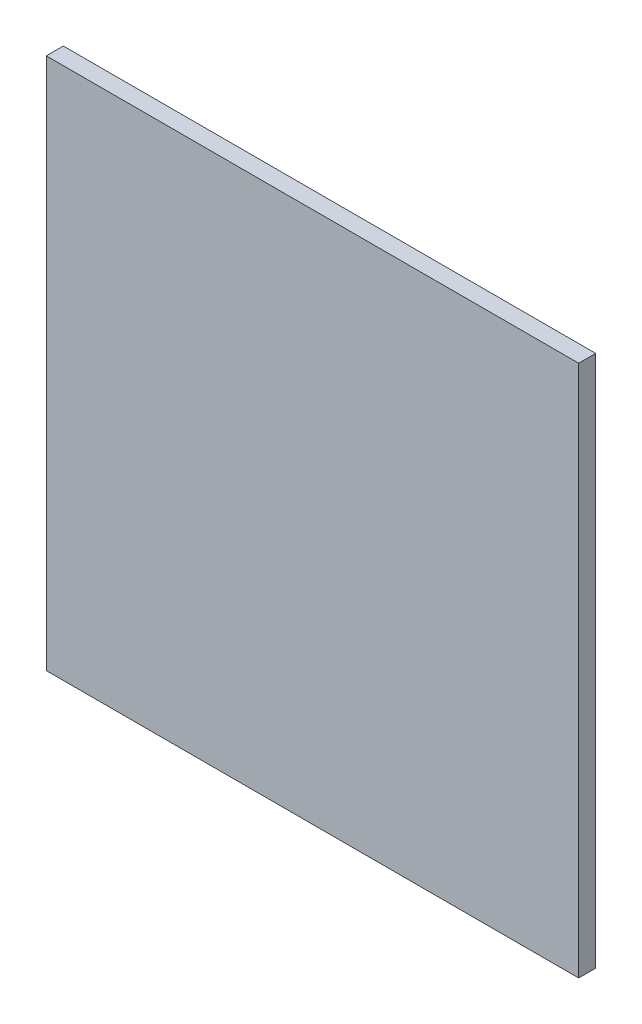
ISO-10303-21;
HEADER;
FILE_DESCRIPTION(('STEP AP214'),'2;1');
FILE_NAME('part.step','',(''),(''),'','','');
FILE_SCHEMA(('AUTOMOTIVE_DESIGN { 1 0 10303 214 1 1 1 1 }'));
ENDSEC;
DATA;
#1=APPLICATION_CONTEXT('core data for automotive mechanical design processes');
#2=APPLICATION_PROTOCOL_DEFINITION('international standard','automotive_design',2000,#1);
#3=PRODUCT_CONTEXT('',#1,'mechanical');
#4=PRODUCT('Part','Part','',(#3));
#5=PRODUCT_RELATED_PRODUCT_CATEGORY('part','',(#4));
#6=PRODUCT_DEFINITION_FORMATION('','',#4);
#7=PRODUCT_DEFINITION_CONTEXT('part definition',#1,'design');
#8=PRODUCT_DEFINITION('design','',#6,#7);
#9=PRODUCT_DEFINITION_SHAPE('','',#8);
#10=(LENGTH_UNIT() NAMED_UNIT(*) SI_UNIT(.MILLI.,.METRE.));
#11=(NAMED_UNIT(*) PLANE_ANGLE_UNIT() SI_UNIT($,.RADIAN.));
#12=(NAMED_UNIT(*) SI_UNIT($,.STERADIAN.) SOLID_ANGLE_UNIT());
#13=UNCERTAINTY_MEASURE_WITH_UNIT(LENGTH_MEASURE(1.E-05),#10,'distance_accuracy_value','');
#14=(GEOMETRIC_REPRESENTATION_CONTEXT(3) GLOBAL_UNCERTAINTY_ASSIGNED_CONTEXT((#13)) GLOBAL_UNIT_ASSIGNED_CONTEXT((#10,
#11,#12)) REPRESENTATION_CONTEXT('',''));
#15=CARTESIAN_POINT('',(0.,0.,0.));
#16=DIRECTION('',(0.,0.,1.));
#17=DIRECTION('',(1.,0.,0.));
#18=AXIS2_PLACEMENT_3D('',#15,#16,#17);
#19=CARTESIAN_POINT('',(50.,-50.,3.2));
#20=DIRECTION('',(-1.,0.,0.));
#21=DIRECTION('',(0.,0.,1.));
#22=AXIS2_PLACEMENT_3D('',#19,#20,#21);
#23=PLANE('',#22);
#24=DIRECTION('',(0.,1.,0.));
#25=VECTOR('',#24,1.);
#26=CARTESIAN_POINT('',(50.,-50.,0.));
#27=LINE('',#26,#25);
#28=CARTESIAN_POINT('',(50.,-50.,0.));
#29=VERTEX_POINT('',#28);
#30=CARTESIAN_POINT('',(50.,50.,0.));
#31=VERTEX_POINT('',#30);
#32=EDGE_CURVE('E96',#29,#31,#27,.T.);
#33=ORIENTED_EDGE('',*,*,#32,.T.);
#34=DIRECTION('',(0.,0.,-1.));
#35=VECTOR('',#34,1.);
#36=CARTESIAN_POINT('',(50.,50.,3.2));
#37=LINE('',#36,#35);
#38=CARTESIAN_POINT('',(50.,50.,3.2));
#39=VERTEX_POINT('',#38);
#40=EDGE_CURVE('E11',#39,#31,#37,.T.);
#41=ORIENTED_EDGE('',*,*,#40,.F.);
#42=DIRECTION('',(0.,1.,0.));
#43=VECTOR('',#42,1.);
#44=CARTESIAN_POINT('',(50.,-50.,3.2));
#45=LINE('',#44,#43);
#46=CARTESIAN_POINT('',(50.,-50.,3.2));
#47=VERTEX_POINT('',#46);
#48=EDGE_CURVE('E84',#47,#39,#45,.T.);
#49=ORIENTED_EDGE('',*,*,#48,.F.);
#50=DIRECTION('',(0.,0.,-1.));
#51=VECTOR('',#50,1.);
#52=CARTESIAN_POINT('',(50.,-50.,3.2));
#53=LINE('',#52,#51);
#54=EDGE_CURVE('E92',#47,#29,#53,.T.);
#55=ORIENTED_EDGE('',*,*,#54,.T.);
#56=EDGE_LOOP('',(#33,#41,#49,#55));
#57=FACE_BOUND('',#56,.T.);
#58=ADVANCED_FACE('F33',(#57),#23,.F.);
#59=CARTESIAN_POINT('',(-50.,50.,3.2));
#60=DIRECTION('',(0.,-1.,0.));
#61=DIRECTION('',(0.,0.,-1.));
#62=AXIS2_PLACEMENT_3D('',#59,#60,#61);
#63=PLANE('',#62);
#64=DIRECTION('',(-1.,0.,0.));
#65=VECTOR('',#64,1.);
#66=CARTESIAN_POINT('',(-50.,50.,0.));
#67=LINE('',#66,#65);
#68=CARTESIAN_POINT('',(-50.,50.,0.));
#69=VERTEX_POINT('',#68);
#70=EDGE_CURVE('E88',#31,#69,#67,.T.);
#71=ORIENTED_EDGE('',*,*,#70,.T.);
#72=DIRECTION('',(0.,0.,-1.));
#73=VECTOR('',#72,1.);
#74=CARTESIAN_POINT('',(-50.,50.,3.2));
#75=LINE('',#74,#73);
#76=CARTESIAN_POINT('',(-50.,50.,3.2));
#77=VERTEX_POINT('',#76);
#78=EDGE_CURVE('E41',#77,#69,#75,.T.);
#79=ORIENTED_EDGE('',*,*,#78,.F.);
#80=DIRECTION('',(-1.,0.,0.));
#81=VECTOR('',#80,1.);
#82=CARTESIAN_POINT('',(-50.,50.,3.2));
#83=LINE('',#82,#81);
#84=EDGE_CURVE('E79',#39,#77,#83,.T.);
#85=ORIENTED_EDGE('',*,*,#84,.F.);
#86=ORIENTED_EDGE('',*,*,#40,.T.);
#87=EDGE_LOOP('',(#71,#79,#85,#86));
#88=FACE_BOUND('',#87,.T.);
#89=ADVANCED_FACE('F87',(#88),#63,.F.);
#90=CARTESIAN_POINT('',(-50.,-50.,3.2));
#91=DIRECTION('',(1.,0.,0.));
#92=DIRECTION('',(0.,0.,-1.));
#93=AXIS2_PLACEMENT_3D('',#90,#91,#92);
#94=PLANE('',#93);
#95=DIRECTION('',(0.,-1.,0.));
#96=VECTOR('',#95,1.);
#97=CARTESIAN_POINT('',(-50.,-50.,0.));
#98=LINE('',#97,#96);
#99=CARTESIAN_POINT('',(-50.,-50.,0.));
#100=VERTEX_POINT('',#99);
#101=EDGE_CURVE('E66',#69,#100,#98,.T.);
#102=ORIENTED_EDGE('',*,*,#101,.T.);
#103=DIRECTION('',(0.,0.,-1.));
#104=VECTOR('',#103,1.);
#105=CARTESIAN_POINT('',(-50.,-50.,3.2));
#106=LINE('',#105,#104);
#107=CARTESIAN_POINT('',(-50.,-50.,3.2));
#108=VERTEX_POINT('',#107);
#109=EDGE_CURVE('E89',#108,#100,#106,.T.);
#110=ORIENTED_EDGE('',*,*,#109,.F.);
#111=DIRECTION('',(0.,-1.,0.));
#112=VECTOR('',#111,1.);
#113=CARTESIAN_POINT('',(-50.,-50.,3.2));
#114=LINE('',#113,#112);
#115=EDGE_CURVE('E82',#77,#108,#114,.T.);
#116=ORIENTED_EDGE('',*,*,#115,.F.);
#117=ORIENTED_EDGE('',*,*,#78,.T.);
#118=EDGE_LOOP('',(#102,#110,#116,#117));
#119=FACE_BOUND('',#118,.T.);
#120=ADVANCED_FACE('F90',(#119),#94,.F.);
#121=CARTESIAN_POINT('',(-50.,-50.,3.2));
#122=DIRECTION('',(0.,1.,0.));
#123=DIRECTION('',(0.,0.,1.));
#124=AXIS2_PLACEMENT_3D('',#121,#122,#123);
#125=PLANE('',#124);
#126=DIRECTION('',(1.,0.,0.));
#127=VECTOR('',#126,1.);
#128=CARTESIAN_POINT('',(-50.,-50.,0.));
#129=LINE('',#128,#127);
#130=EDGE_CURVE('E72',#100,#29,#129,.T.);
#131=ORIENTED_EDGE('',*,*,#130,.T.);
#132=ORIENTED_EDGE('',*,*,#54,.F.);
#133=DIRECTION('',(1.,0.,0.));
#134=VECTOR('',#133,1.);
#135=CARTESIAN_POINT('',(-50.,-50.,3.2));
#136=LINE('',#135,#134);
#137=EDGE_CURVE('E49',#108,#47,#136,.T.);
#138=ORIENTED_EDGE('',*,*,#137,.F.);
#139=ORIENTED_EDGE('',*,*,#109,.T.);
#140=EDGE_LOOP('',(#131,#132,#138,#139));
#141=FACE_BOUND('',#140,.T.);
#142=ADVANCED_FACE('F103',(#141),#125,.F.);
#143=CARTESIAN_POINT('',(0.,0.,3.2));
#144=DIRECTION('',(0.,0.,-1.));
#145=DIRECTION('',(-1.,0.,0.));
#146=AXIS2_PLACEMENT_3D('',#143,#144,#145);
#147=PLANE('',#146);
#148=ORIENTED_EDGE('',*,*,#48,.T.);
#149=ORIENTED_EDGE('',*,*,#84,.T.);
#150=ORIENTED_EDGE('',*,*,#115,.T.);
#151=ORIENTED_EDGE('',*,*,#137,.T.);
#152=EDGE_LOOP('',(#148,#149,#150,#151));
#153=FACE_BOUND('',#152,.T.);
#154=ADVANCED_FACE('F80',(#153),#147,.F.);
#155=CARTESIAN_POINT('',(0.,0.,0.));
#156=DIRECTION('',(0.,0.,-1.));
#157=DIRECTION('',(-1.,0.,0.));
#158=AXIS2_PLACEMENT_3D('',#155,#156,#157);
#159=PLANE('',#158);
#160=ORIENTED_EDGE('',*,*,#32,.F.);
#161=ORIENTED_EDGE('',*,*,#130,.F.);
#162=ORIENTED_EDGE('',*,*,#101,.F.);
#163=ORIENTED_EDGE('',*,*,#70,.F.);
#164=EDGE_LOOP('',(#160,#161,#162,#163));
#165=FACE_BOUND('',#164,.T.);
#166=ADVANCED_FACE('F106',(#165),#159,.T.);
#167=CLOSED_SHELL('',(#58,#89,#120,#142,#154,#166));
#168=MANIFOLD_SOLID_BREP('B2',#167);
#169=ADVANCED_BREP_SHAPE_REPRESENTATION('',(#18,#168),#14);
#170=SHAPE_DEFINITION_REPRESENTATION(#9,#169);
ENDSEC;
END-ISO-10303-21;
